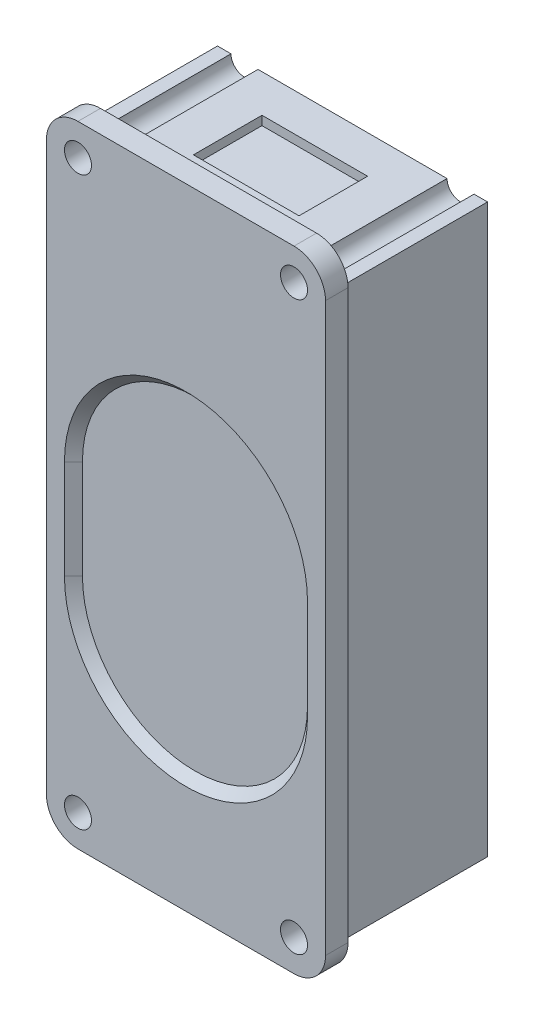
ISO-10303-21;
HEADER;
FILE_DESCRIPTION(('STEP AP214'),'2;1');
FILE_NAME('part.step','',(''),(''),'','','');
FILE_SCHEMA(('AUTOMOTIVE_DESIGN { 1 0 10303 214 1 1 1 1 }'));
ENDSEC;
DATA;
#1=APPLICATION_CONTEXT('core data for automotive mechanical design processes');
#2=APPLICATION_PROTOCOL_DEFINITION('international standard','automotive_design',2000,#1);
#3=PRODUCT_CONTEXT('',#1,'mechanical');
#4=PRODUCT('Part','Part','',(#3));
#5=PRODUCT_RELATED_PRODUCT_CATEGORY('part','',(#4));
#6=PRODUCT_DEFINITION_FORMATION('','',#4);
#7=PRODUCT_DEFINITION_CONTEXT('part definition',#1,'design');
#8=PRODUCT_DEFINITION('design','',#6,#7);
#9=PRODUCT_DEFINITION_SHAPE('','',#8);
#10=(LENGTH_UNIT() NAMED_UNIT(*) SI_UNIT(.MILLI.,.METRE.));
#11=(NAMED_UNIT(*) PLANE_ANGLE_UNIT() SI_UNIT($,.RADIAN.));
#12=(NAMED_UNIT(*) SI_UNIT($,.STERADIAN.) SOLID_ANGLE_UNIT());
#13=UNCERTAINTY_MEASURE_WITH_UNIT(LENGTH_MEASURE(1.E-05),#10,'distance_accuracy_value','');
#14=(GEOMETRIC_REPRESENTATION_CONTEXT(3) GLOBAL_UNCERTAINTY_ASSIGNED_CONTEXT((#13)) GLOBAL_UNIT_ASSIGNED_CONTEXT((#10,
#11,#12)) REPRESENTATION_CONTEXT('',''));
#15=CARTESIAN_POINT('',(0.,0.,0.));
#16=DIRECTION('',(0.,0.,1.));
#17=DIRECTION('',(1.,0.,0.));
#18=AXIS2_PLACEMENT_3D('',#15,#16,#17);
#19=CARTESIAN_POINT('',(15.,31.5,0.));
#20=DIRECTION('',(0.,-1.,0.));
#21=DIRECTION('',(0.,0.,-1.));
#22=AXIS2_PLACEMENT_3D('',#19,#20,#21);
#23=PLANE('',#22);
#24=DIRECTION('',(-1.,0.,0.));
#25=VECTOR('',#24,1.);
#26=CARTESIAN_POINT('',(-5.86625350488021,31.5,-11.8080308784381));
#27=LINE('',#26,#25);
#28=CARTESIAN_POINT('',(5.86625350488021,31.5,-11.8080308784381));
#29=VERTEX_POINT('',#28);
#30=CARTESIAN_POINT('',(-5.86625350488021,31.5,-11.8080308784381));
#31=VERTEX_POINT('',#30);
#32=EDGE_CURVE('E264',#29,#31,#27,.T.);
#33=ORIENTED_EDGE('',*,*,#32,.F.);
#34=DIRECTION('',(0.,0.,-1.));
#35=VECTOR('',#34,1.);
#36=CARTESIAN_POINT('',(5.86625350488021,31.5,-11.8080308784381));
#37=LINE('',#36,#35);
#38=CARTESIAN_POINT('',(5.86625350488021,31.5,-4.1919691215619));
#39=VERTEX_POINT('',#38);
#40=EDGE_CURVE('E58',#39,#29,#37,.T.);
#41=ORIENTED_EDGE('',*,*,#40,.F.);
#42=DIRECTION('',(1.,0.,0.));
#43=VECTOR('',#42,1.);
#44=CARTESIAN_POINT('',(-5.86625350488021,31.5,-4.1919691215619));
#45=LINE('',#44,#43);
#46=CARTESIAN_POINT('',(-5.86625350488021,31.5,-4.1919691215619));
#47=VERTEX_POINT('',#46);
#48=EDGE_CURVE('E251',#47,#39,#45,.T.);
#49=ORIENTED_EDGE('',*,*,#48,.F.);
#50=DIRECTION('',(0.,0.,1.));
#51=VECTOR('',#50,1.);
#52=CARTESIAN_POINT('',(-5.86625350488021,31.5,-11.8080308784381));
#53=LINE('',#52,#51);
#54=EDGE_CURVE('E255',#31,#47,#53,.T.);
#55=ORIENTED_EDGE('',*,*,#54,.F.);
#56=EDGE_LOOP('',(#33,#41,#49,#55));
#57=FACE_BOUND('',#56,.T.);
#58=DIRECTION('',(-1.,0.,0.));
#59=VECTOR('',#58,1.);
#60=CARTESIAN_POINT('',(15.,31.5,-16.));
#61=LINE('',#60,#59);
#62=CARTESIAN_POINT('',(10.5,31.5,-16.));
#63=VERTEX_POINT('',#62);
#64=CARTESIAN_POINT('',(-10.5,31.5,-16.));
#65=VERTEX_POINT('',#64);
#66=EDGE_CURVE('E421',#63,#65,#61,.T.);
#67=ORIENTED_EDGE('',*,*,#66,.T.);
#68=DIRECTION('',(0.,0.,1.));
#69=VECTOR('',#68,1.);
#70=CARTESIAN_POINT('',(-10.5,31.5,-16.));
#71=LINE('',#70,#69);
#72=CARTESIAN_POINT('',(-10.5,31.5,0.));
#73=VERTEX_POINT('',#72);
#74=EDGE_CURVE('E11',#65,#73,#71,.T.);
#75=ORIENTED_EDGE('',*,*,#74,.T.);
#76=DIRECTION('',(-1.,0.,0.));
#77=VECTOR('',#76,1.);
#78=CARTESIAN_POINT('',(15.,31.5,0.));
#79=LINE('',#78,#77);
#80=CARTESIAN_POINT('',(10.5,31.5,0.));
#81=VERTEX_POINT('',#80);
#82=EDGE_CURVE('E415',#81,#73,#79,.T.);
#83=ORIENTED_EDGE('',*,*,#82,.F.);
#84=DIRECTION('',(0.,0.,1.));
#85=VECTOR('',#84,1.);
#86=CARTESIAN_POINT('',(10.5,31.5,-16.));
#87=LINE('',#86,#85);
#88=EDGE_CURVE('E519',#81,#63,#87,.F.);
#89=ORIENTED_EDGE('',*,*,#88,.T.);
#90=EDGE_LOOP('',(#67,#75,#83,#89));
#91=FACE_BOUND('',#90,.T.);
#92=ADVANCED_FACE('F42',(#57,#91),#23,.F.);
#93=CARTESIAN_POINT('',(15.,31.5,-16.));
#94=VERTEX_POINT('',#93);
#95=CARTESIAN_POINT('',(13.5,31.5,-16.));
#96=VERTEX_POINT('',#95);
#97=EDGE_CURVE('E416',#94,#96,#61,.T.);
#98=ORIENTED_EDGE('',*,*,#97,.T.);
#99=DIRECTION('',(0.,0.,1.));
#100=VECTOR('',#99,1.);
#101=CARTESIAN_POINT('',(13.5,31.5,-16.));
#102=LINE('',#101,#100);
#103=CARTESIAN_POINT('',(13.5,31.5,0.));
#104=VERTEX_POINT('',#103);
#105=EDGE_CURVE('E523',#96,#104,#102,.T.);
#106=ORIENTED_EDGE('',*,*,#105,.T.);
#107=CARTESIAN_POINT('',(15.,31.5,0.));
#108=VERTEX_POINT('',#107);
#109=EDGE_CURVE('E410',#108,#104,#79,.T.);
#110=ORIENTED_EDGE('',*,*,#109,.F.);
#111=DIRECTION('',(0.,0.,1.));
#112=VECTOR('',#111,1.);
#113=CARTESIAN_POINT('',(15.,31.5,0.));
#114=LINE('',#113,#112);
#115=EDGE_CURVE('E373',#94,#108,#114,.T.);
#116=ORIENTED_EDGE('',*,*,#115,.F.);
#117=EDGE_LOOP('',(#98,#106,#110,#116));
#118=FACE_BOUND('',#117,.T.);
#119=ADVANCED_FACE('F548',(#118),#23,.F.);
#120=CARTESIAN_POINT('',(15.,-31.5,0.));
#121=DIRECTION('',(0.,1.,0.));
#122=DIRECTION('',(0.,0.,1.));
#123=AXIS2_PLACEMENT_3D('',#120,#121,#122);
#124=PLANE('',#123);
#125=DIRECTION('',(-1.,0.,0.));
#126=VECTOR('',#125,1.);
#127=CARTESIAN_POINT('',(15.,-31.5,-16.));
#128=LINE('',#127,#126);
#129=CARTESIAN_POINT('',(10.5,-31.5,-16.));
#130=VERTEX_POINT('',#129);
#131=CARTESIAN_POINT('',(-10.5,-31.5,-16.));
#132=VERTEX_POINT('',#131);
#133=EDGE_CURVE('E403',#130,#132,#128,.T.);
#134=ORIENTED_EDGE('',*,*,#133,.F.);
#135=DIRECTION('',(0.,0.,1.));
#136=VECTOR('',#135,1.);
#137=CARTESIAN_POINT('',(10.5,-31.5,-16.));
#138=LINE('',#137,#136);
#139=CARTESIAN_POINT('',(10.5,-31.5,0.));
#140=VERTEX_POINT('',#139);
#141=EDGE_CURVE('E515',#130,#140,#138,.T.);
#142=ORIENTED_EDGE('',*,*,#141,.T.);
#143=DIRECTION('',(-1.,0.,0.));
#144=VECTOR('',#143,1.);
#145=CARTESIAN_POINT('',(15.,-31.5,0.));
#146=LINE('',#145,#144);
#147=CARTESIAN_POINT('',(-10.5,-31.5,0.));
#148=VERTEX_POINT('',#147);
#149=EDGE_CURVE('E409',#140,#148,#146,.T.);
#150=ORIENTED_EDGE('',*,*,#149,.T.);
#151=DIRECTION('',(0.,0.,1.));
#152=VECTOR('',#151,1.);
#153=CARTESIAN_POINT('',(-10.5,-31.5,-16.));
#154=LINE('',#153,#152);
#155=EDGE_CURVE('E503',#148,#132,#154,.F.);
#156=ORIENTED_EDGE('',*,*,#155,.T.);
#157=EDGE_LOOP('',(#134,#142,#150,#156));
#158=FACE_BOUND('',#157,.T.);
#159=ADVANCED_FACE('F601',(#158),#124,.F.);
#160=CARTESIAN_POINT('',(-13.5,-31.5,-16.));
#161=VERTEX_POINT('',#160);
#162=CARTESIAN_POINT('',(-15.,-31.5,-16.));
#163=VERTEX_POINT('',#162);
#164=EDGE_CURVE('E383',#161,#163,#128,.T.);
#165=ORIENTED_EDGE('',*,*,#164,.F.);
#166=DIRECTION('',(0.,0.,1.));
#167=VECTOR('',#166,1.);
#168=CARTESIAN_POINT('',(-13.5,-31.5,-16.));
#169=LINE('',#168,#167);
#170=CARTESIAN_POINT('',(-13.5,-31.5,0.));
#171=VERTEX_POINT('',#170);
#172=EDGE_CURVE('E507',#161,#171,#169,.T.);
#173=ORIENTED_EDGE('',*,*,#172,.T.);
#174=CARTESIAN_POINT('',(-15.,-31.5,0.));
#175=VERTEX_POINT('',#174);
#176=EDGE_CURVE('E402',#171,#175,#146,.T.);
#177=ORIENTED_EDGE('',*,*,#176,.T.);
#178=DIRECTION('',(0.,0.,-1.));
#179=VECTOR('',#178,1.);
#180=CARTESIAN_POINT('',(-15.,-31.5,0.));
#181=LINE('',#180,#179);
#182=EDGE_CURVE('E374',#175,#163,#181,.T.);
#183=ORIENTED_EDGE('',*,*,#182,.T.);
#184=EDGE_LOOP('',(#165,#173,#177,#183));
#185=FACE_BOUND('',#184,.T.);
#186=ADVANCED_FACE('F574',(#185),#124,.F.);
#187=CARTESIAN_POINT('',(12.,-31.5,2.5));
#188=DIRECTION('',(0.,0.,-1.));
#189=DIRECTION('',(-1.,0.,0.));
#190=AXIS2_PLACEMENT_3D('',#187,#188,#189);
#191=CYLINDRICAL_SURFACE('',#190,3.5);
#192=CARTESIAN_POINT('',(12.,-31.5,0.));
#193=DIRECTION('',(0.,0.,1.));
#194=DIRECTION('',(1.,0.,0.));
#195=AXIS2_PLACEMENT_3D('',#192,#193,#194);
#196=CIRCLE('',#195,3.5);
#197=CARTESIAN_POINT('',(12.,-35.,0.));
#198=VERTEX_POINT('',#197);
#199=CARTESIAN_POINT('',(15.5,-31.5,0.));
#200=VERTEX_POINT('',#199);
#201=EDGE_CURVE('E420',#198,#200,#196,.T.);
#202=ORIENTED_EDGE('',*,*,#201,.T.);
#203=DIRECTION('',(0.,0.,-1.));
#204=VECTOR('',#203,1.);
#205=CARTESIAN_POINT('',(15.5,-31.5,2.5));
#206=LINE('',#205,#204);
#207=CARTESIAN_POINT('',(15.5,-31.5,2.5));
#208=VERTEX_POINT('',#207);
#209=EDGE_CURVE('E499',#208,#200,#206,.T.);
#210=ORIENTED_EDGE('',*,*,#209,.F.);
#211=CARTESIAN_POINT('',(12.,-31.5,2.5));
#212=DIRECTION('',(0.,0.,1.));
#213=DIRECTION('',(1.,0.,0.));
#214=AXIS2_PLACEMENT_3D('',#211,#212,#213);
#215=CIRCLE('',#214,3.5);
#216=CARTESIAN_POINT('',(12.,-35.,2.5));
#217=VERTEX_POINT('',#216);
#218=EDGE_CURVE('E422',#217,#208,#215,.T.);
#219=ORIENTED_EDGE('',*,*,#218,.F.);
#220=DIRECTION('',(0.,0.,-1.));
#221=VECTOR('',#220,1.);
#222=CARTESIAN_POINT('',(12.,-35.,2.5));
#223=LINE('',#222,#221);
#224=EDGE_CURVE('E448',#217,#198,#223,.T.);
#225=ORIENTED_EDGE('',*,*,#224,.T.);
#226=EDGE_LOOP('',(#202,#210,#219,#225));
#227=FACE_BOUND('',#226,.T.);
#228=ADVANCED_FACE('F44',(#227),#191,.T.);
#229=CARTESIAN_POINT('',(15.5,31.5,2.5));
#230=DIRECTION('',(-1.,0.,0.));
#231=DIRECTION('',(0.,-1.,0.));
#232=AXIS2_PLACEMENT_3D('',#229,#230,#231);
#233=PLANE('',#232);
#234=DIRECTION('',(0.,1.,0.));
#235=VECTOR('',#234,1.);
#236=CARTESIAN_POINT('',(15.5,31.5,0.));
#237=LINE('',#236,#235);
#238=CARTESIAN_POINT('',(15.5,31.5,0.));
#239=VERTEX_POINT('',#238);
#240=EDGE_CURVE('E452',#200,#239,#237,.T.);
#241=ORIENTED_EDGE('',*,*,#240,.T.);
#242=DIRECTION('',(0.,0.,-1.));
#243=VECTOR('',#242,1.);
#244=CARTESIAN_POINT('',(15.5,31.5,2.5));
#245=LINE('',#244,#243);
#246=CARTESIAN_POINT('',(15.5,31.5,2.5));
#247=VERTEX_POINT('',#246);
#248=EDGE_CURVE('E495',#247,#239,#245,.T.);
#249=ORIENTED_EDGE('',*,*,#248,.F.);
#250=DIRECTION('',(0.,1.,0.));
#251=VECTOR('',#250,1.);
#252=CARTESIAN_POINT('',(15.5,31.5,2.5));
#253=LINE('',#252,#251);
#254=EDGE_CURVE('E426',#208,#247,#253,.T.);
#255=ORIENTED_EDGE('',*,*,#254,.F.);
#256=ORIENTED_EDGE('',*,*,#209,.T.);
#257=EDGE_LOOP('',(#241,#249,#255,#256));
#258=FACE_BOUND('',#257,.T.);
#259=ADVANCED_FACE('F640',(#258),#233,.F.);
#260=CARTESIAN_POINT('',(12.,31.5,2.5));
#261=DIRECTION('',(0.,0.,-1.));
#262=DIRECTION('',(-1.,0.,0.));
#263=AXIS2_PLACEMENT_3D('',#260,#261,#262);
#264=CYLINDRICAL_SURFACE('',#263,3.5);
#265=CARTESIAN_POINT('',(12.,31.5,0.));
#266=DIRECTION('',(0.,0.,1.));
#267=DIRECTION('',(-1.,0.,0.));
#268=AXIS2_PLACEMENT_3D('',#265,#266,#267);
#269=CIRCLE('',#268,3.5);
#270=CARTESIAN_POINT('',(12.,35.,0.));
#271=VERTEX_POINT('',#270);
#272=EDGE_CURVE('E455',#239,#271,#269,.T.);
#273=ORIENTED_EDGE('',*,*,#272,.T.);
#274=DIRECTION('',(0.,0.,-1.));
#275=VECTOR('',#274,1.);
#276=CARTESIAN_POINT('',(12.,35.,2.5));
#277=LINE('',#276,#275);
#278=CARTESIAN_POINT('',(12.,35.,2.5));
#279=VERTEX_POINT('',#278);
#280=EDGE_CURVE('E491',#279,#271,#277,.T.);
#281=ORIENTED_EDGE('',*,*,#280,.F.);
#282=CARTESIAN_POINT('',(12.,31.5,2.5));
#283=DIRECTION('',(0.,0.,1.));
#284=DIRECTION('',(-1.,0.,0.));
#285=AXIS2_PLACEMENT_3D('',#282,#283,#284);
#286=CIRCLE('',#285,3.5);
#287=EDGE_CURVE('E430',#247,#279,#286,.T.);
#288=ORIENTED_EDGE('',*,*,#287,.F.);
#289=ORIENTED_EDGE('',*,*,#248,.T.);
#290=EDGE_LOOP('',(#273,#281,#288,#289));
#291=FACE_BOUND('',#290,.T.);
#292=ADVANCED_FACE('F637',(#291),#264,.T.);
#293=CARTESIAN_POINT('',(-12.,35.,2.5));
#294=DIRECTION('',(0.,-1.,0.));
#295=DIRECTION('',(0.,0.,-1.));
#296=AXIS2_PLACEMENT_3D('',#293,#294,#295);
#297=PLANE('',#296);
#298=DIRECTION('',(-1.,0.,0.));
#299=VECTOR('',#298,1.);
#300=CARTESIAN_POINT('',(-12.,35.,0.));
#301=LINE('',#300,#299);
#302=CARTESIAN_POINT('',(-12.,35.,0.));
#303=VERTEX_POINT('',#302);
#304=EDGE_CURVE('E458',#271,#303,#301,.T.);
#305=ORIENTED_EDGE('',*,*,#304,.T.);
#306=DIRECTION('',(0.,0.,-1.));
#307=VECTOR('',#306,1.);
#308=CARTESIAN_POINT('',(-12.,35.,2.5));
#309=LINE('',#308,#307);
#310=CARTESIAN_POINT('',(-12.,35.,2.5));
#311=VERTEX_POINT('',#310);
#312=EDGE_CURVE('E487',#311,#303,#309,.T.);
#313=ORIENTED_EDGE('',*,*,#312,.F.);
#314=DIRECTION('',(-1.,0.,0.));
#315=VECTOR('',#314,1.);
#316=CARTESIAN_POINT('',(-12.,35.,2.5));
#317=LINE('',#316,#315);
#318=EDGE_CURVE('E433',#279,#311,#317,.T.);
#319=ORIENTED_EDGE('',*,*,#318,.F.);
#320=ORIENTED_EDGE('',*,*,#280,.T.);
#321=EDGE_LOOP('',(#305,#313,#319,#320));
#322=FACE_BOUND('',#321,.T.);
#323=ADVANCED_FACE('F633',(#322),#297,.F.);
#324=CARTESIAN_POINT('',(-12.,31.5,2.5));
#325=DIRECTION('',(0.,0.,-1.));
#326=DIRECTION('',(-1.,0.,0.));
#327=AXIS2_PLACEMENT_3D('',#324,#325,#326);
#328=CYLINDRICAL_SURFACE('',#327,3.5);
#329=CARTESIAN_POINT('',(-12.,31.5,0.));
#330=DIRECTION('',(0.,0.,1.));
#331=DIRECTION('',(1.,0.,0.));
#332=AXIS2_PLACEMENT_3D('',#329,#330,#331);
#333=CIRCLE('',#332,3.5);
#334=CARTESIAN_POINT('',(-15.5,31.5,0.));
#335=VERTEX_POINT('',#334);
#336=EDGE_CURVE('E461',#303,#335,#333,.T.);
#337=ORIENTED_EDGE('',*,*,#336,.T.);
#338=DIRECTION('',(0.,0.,-1.));
#339=VECTOR('',#338,1.);
#340=CARTESIAN_POINT('',(-15.5,31.5,2.5));
#341=LINE('',#340,#339);
#342=CARTESIAN_POINT('',(-15.5,31.5,2.5));
#343=VERTEX_POINT('',#342);
#344=EDGE_CURVE('E483',#343,#335,#341,.T.);
#345=ORIENTED_EDGE('',*,*,#344,.F.);
#346=CARTESIAN_POINT('',(-12.,31.5,2.5));
#347=DIRECTION('',(0.,0.,1.));
#348=DIRECTION('',(1.,0.,0.));
#349=AXIS2_PLACEMENT_3D('',#346,#347,#348);
#350=CIRCLE('',#349,3.5);
#351=EDGE_CURVE('E436',#311,#343,#350,.T.);
#352=ORIENTED_EDGE('',*,*,#351,.F.);
#353=ORIENTED_EDGE('',*,*,#312,.T.);
#354=EDGE_LOOP('',(#337,#345,#352,#353));
#355=FACE_BOUND('',#354,.T.);
#356=ADVANCED_FACE('F629',(#355),#328,.T.);
#357=CARTESIAN_POINT('',(-15.5,31.5,2.5));
#358=DIRECTION('',(1.,0.,0.));
#359=DIRECTION('',(0.,1.,0.));
#360=AXIS2_PLACEMENT_3D('',#357,#358,#359);
#361=PLANE('',#360);
#362=DIRECTION('',(0.,-1.,0.));
#363=VECTOR('',#362,1.);
#364=CARTESIAN_POINT('',(-15.5,31.5,0.));
#365=LINE('',#364,#363);
#366=CARTESIAN_POINT('',(-15.5,-31.5,0.));
#367=VERTEX_POINT('',#366);
#368=EDGE_CURVE('E464',#335,#367,#365,.T.);
#369=ORIENTED_EDGE('',*,*,#368,.T.);
#370=DIRECTION('',(0.,0.,-1.));
#371=VECTOR('',#370,1.);
#372=CARTESIAN_POINT('',(-15.5,-31.5,2.5));
#373=LINE('',#372,#371);
#374=CARTESIAN_POINT('',(-15.5,-31.5,2.5));
#375=VERTEX_POINT('',#374);
#376=EDGE_CURVE('E479',#375,#367,#373,.T.);
#377=ORIENTED_EDGE('',*,*,#376,.F.);
#378=DIRECTION('',(0.,-1.,0.));
#379=VECTOR('',#378,1.);
#380=CARTESIAN_POINT('',(-15.5,31.5,2.5));
#381=LINE('',#380,#379);
#382=EDGE_CURVE('E439',#343,#375,#381,.T.);
#383=ORIENTED_EDGE('',*,*,#382,.F.);
#384=ORIENTED_EDGE('',*,*,#344,.T.);
#385=EDGE_LOOP('',(#369,#377,#383,#384));
#386=FACE_BOUND('',#385,.T.);
#387=ADVANCED_FACE('F625',(#386),#361,.F.);
#388=CARTESIAN_POINT('',(-12.,-31.5,2.5));
#389=DIRECTION('',(0.,0.,-1.));
#390=DIRECTION('',(-1.,0.,0.));
#391=AXIS2_PLACEMENT_3D('',#388,#389,#390);
#392=CYLINDRICAL_SURFACE('',#391,3.5);
#393=CARTESIAN_POINT('',(-12.,-31.5,0.));
#394=DIRECTION('',(0.,0.,1.));
#395=DIRECTION('',(1.,0.,0.));
#396=AXIS2_PLACEMENT_3D('',#393,#394,#395);
#397=CIRCLE('',#396,3.5);
#398=CARTESIAN_POINT('',(-12.,-35.,0.));
#399=VERTEX_POINT('',#398);
#400=EDGE_CURVE('E467',#367,#399,#397,.T.);
#401=ORIENTED_EDGE('',*,*,#400,.T.);
#402=DIRECTION('',(0.,0.,-1.));
#403=VECTOR('',#402,1.);
#404=CARTESIAN_POINT('',(-12.,-35.,2.5));
#405=LINE('',#404,#403);
#406=CARTESIAN_POINT('',(-12.,-35.,2.5));
#407=VERTEX_POINT('',#406);
#408=EDGE_CURVE('E475',#407,#399,#405,.T.);
#409=ORIENTED_EDGE('',*,*,#408,.F.);
#410=CARTESIAN_POINT('',(-12.,-31.5,2.5));
#411=DIRECTION('',(0.,0.,1.));
#412=DIRECTION('',(1.,0.,0.));
#413=AXIS2_PLACEMENT_3D('',#410,#411,#412);
#414=CIRCLE('',#413,3.5);
#415=EDGE_CURVE('E442',#375,#407,#414,.T.);
#416=ORIENTED_EDGE('',*,*,#415,.F.);
#417=ORIENTED_EDGE('',*,*,#376,.T.);
#418=EDGE_LOOP('',(#401,#409,#416,#417));
#419=FACE_BOUND('',#418,.T.);
#420=ADVANCED_FACE('F621',(#419),#392,.T.);
#421=CARTESIAN_POINT('',(-12.,-35.,2.5));
#422=DIRECTION('',(0.,1.,0.));
#423=DIRECTION('',(0.,0.,1.));
#424=AXIS2_PLACEMENT_3D('',#421,#422,#423);
#425=PLANE('',#424);
#426=DIRECTION('',(1.,0.,0.));
#427=VECTOR('',#426,1.);
#428=CARTESIAN_POINT('',(-12.,-35.,0.));
#429=LINE('',#428,#427);
#430=EDGE_CURVE('E427',#399,#198,#429,.T.);
#431=ORIENTED_EDGE('',*,*,#430,.T.);
#432=ORIENTED_EDGE('',*,*,#224,.F.);
#433=DIRECTION('',(1.,0.,0.));
#434=VECTOR('',#433,1.);
#435=CARTESIAN_POINT('',(-12.,-35.,2.5));
#436=LINE('',#435,#434);
#437=EDGE_CURVE('E445',#407,#217,#436,.T.);
#438=ORIENTED_EDGE('',*,*,#437,.F.);
#439=ORIENTED_EDGE('',*,*,#408,.T.);
#440=EDGE_LOOP('',(#431,#432,#438,#439));
#441=FACE_BOUND('',#440,.T.);
#442=ADVANCED_FACE('F616',(#441),#425,.F.);
#443=CARTESIAN_POINT('',(12.,-31.5,2.5));
#444=DIRECTION('',(0.,0.,1.));
#445=DIRECTION('',(1.,0.,0.));
#446=AXIS2_PLACEMENT_3D('',#443,#444,#445);
#447=PLANE('',#446);
#448=CARTESIAN_POINT('',(0.,1.5,2.5));
#449=DIRECTION('',(0.,0.,1.));
#450=DIRECTION('',(1.,0.,0.));
#451=AXIS2_PLACEMENT_3D('',#448,#449,#450);
#452=CIRCLE('',#451,13.5);
#453=CARTESIAN_POINT('',(13.5,1.5,2.5));
#454=VERTEX_POINT('',#453);
#455=CARTESIAN_POINT('',(-13.5,1.50000000000003,2.5));
#456=VERTEX_POINT('',#455);
#457=EDGE_CURVE('E66',#454,#456,#452,.T.);
#458=ORIENTED_EDGE('',*,*,#457,.F.);
#459=DIRECTION('',(0.,1.,0.));
#460=VECTOR('',#459,1.);
#461=CARTESIAN_POINT('',(13.5,1.5,2.5));
#462=LINE('',#461,#460);
#463=CARTESIAN_POINT('',(13.5,-9.5,2.5));
#464=VERTEX_POINT('',#463);
#465=EDGE_CURVE('E288',#464,#454,#462,.T.);
#466=ORIENTED_EDGE('',*,*,#465,.F.);
#467=CARTESIAN_POINT('',(0.,-9.50000000000001,2.5));
#468=DIRECTION('',(0.,0.,1.));
#469=DIRECTION('',(1.,0.,0.));
#470=AXIS2_PLACEMENT_3D('',#467,#468,#469);
#471=CIRCLE('',#470,13.5);
#472=CARTESIAN_POINT('',(-13.5,-9.50000000000001,2.5));
#473=VERTEX_POINT('',#472);
#474=EDGE_CURVE('E284',#473,#464,#471,.T.);
#475=ORIENTED_EDGE('',*,*,#474,.F.);
#476=DIRECTION('',(0.,-1.,0.));
#477=VECTOR('',#476,1.);
#478=CARTESIAN_POINT('',(-13.5,1.50000000000003,2.5));
#479=LINE('',#478,#477);
#480=EDGE_CURVE('E280',#456,#473,#479,.T.);
#481=ORIENTED_EDGE('',*,*,#480,.F.);
#482=EDGE_LOOP('',(#458,#466,#475,#481));
#483=FACE_BOUND('',#482,.T.);
#484=CARTESIAN_POINT('',(-12.,31.5,2.5));
#485=DIRECTION('',(0.,0.,1.));
#486=DIRECTION('',(-1.,0.,0.));
#487=AXIS2_PLACEMENT_3D('',#484,#485,#486);
#488=CIRCLE('',#487,1.5);
#489=CARTESIAN_POINT('',(-13.5,31.5,2.5));
#490=VERTEX_POINT('',#489);
#491=EDGE_CURVE('E335',#490,#490,#488,.T.);
#492=ORIENTED_EDGE('',*,*,#491,.F.);
#493=EDGE_LOOP('',(#492));
#494=FACE_BOUND('',#493,.T.);
#495=CARTESIAN_POINT('',(12.,31.5,2.5));
#496=DIRECTION('',(0.,0.,1.));
#497=DIRECTION('',(-1.,0.,0.));
#498=AXIS2_PLACEMENT_3D('',#495,#496,#497);
#499=CIRCLE('',#498,1.5);
#500=CARTESIAN_POINT('',(10.5,31.5,2.5));
#501=VERTEX_POINT('',#500);
#502=EDGE_CURVE('E326',#501,#501,#499,.T.);
#503=ORIENTED_EDGE('',*,*,#502,.F.);
#504=EDGE_LOOP('',(#503));
#505=FACE_BOUND('',#504,.T.);
#506=CARTESIAN_POINT('',(12.,-31.5,2.5));
#507=DIRECTION('',(0.,0.,1.));
#508=DIRECTION('',(1.,0.,0.));
#509=AXIS2_PLACEMENT_3D('',#506,#507,#508);
#510=CIRCLE('',#509,1.5);
#511=CARTESIAN_POINT('',(13.5,-31.5,2.5));
#512=VERTEX_POINT('',#511);
#513=EDGE_CURVE('E325',#512,#512,#510,.T.);
#514=ORIENTED_EDGE('',*,*,#513,.F.);
#515=EDGE_LOOP('',(#514));
#516=FACE_BOUND('',#515,.T.);
#517=CARTESIAN_POINT('',(-12.,-31.5,2.5));
#518=DIRECTION('',(0.,0.,1.));
#519=DIRECTION('',(1.,0.,0.));
#520=AXIS2_PLACEMENT_3D('',#517,#518,#519);
#521=CIRCLE('',#520,1.5);
#522=CARTESIAN_POINT('',(-10.5,-31.5,2.5));
#523=VERTEX_POINT('',#522);
#524=EDGE_CURVE('E330',#523,#523,#521,.T.);
#525=ORIENTED_EDGE('',*,*,#524,.F.);
#526=EDGE_LOOP('',(#525));
#527=FACE_BOUND('',#526,.T.);
#528=ORIENTED_EDGE('',*,*,#218,.T.);
#529=ORIENTED_EDGE('',*,*,#254,.T.);
#530=ORIENTED_EDGE('',*,*,#287,.T.);
#531=ORIENTED_EDGE('',*,*,#318,.T.);
#532=ORIENTED_EDGE('',*,*,#351,.T.);
#533=ORIENTED_EDGE('',*,*,#382,.T.);
#534=ORIENTED_EDGE('',*,*,#415,.T.);
#535=ORIENTED_EDGE('',*,*,#437,.T.);
#536=EDGE_LOOP('',(#528,#529,#530,#531,#532,#533,#534,#535));
#537=FACE_BOUND('',#536,.T.);
#538=ADVANCED_FACE('F612',(#483,#494,#505,#516,#527,#537),#447,.T.);
#539=CARTESIAN_POINT('',(12.,-31.5,0.));
#540=DIRECTION('',(0.,0.,1.));
#541=DIRECTION('',(1.,0.,0.));
#542=AXIS2_PLACEMENT_3D('',#539,#540,#541);
#543=PLANE('',#542);
#544=ORIENTED_EDGE('',*,*,#82,.T.);
#545=CARTESIAN_POINT('',(-12.,31.5,0.));
#546=DIRECTION('',(0.,0.,1.));
#547=DIRECTION('',(1.,0.,0.));
#548=AXIS2_PLACEMENT_3D('',#545,#546,#547);
#549=CIRCLE('',#548,1.5);
#550=CARTESIAN_POINT('',(-13.5,31.5,0.));
#551=VERTEX_POINT('',#550);
#552=EDGE_CURVE('E364',#73,#551,#549,.T.);
#553=ORIENTED_EDGE('',*,*,#552,.T.);
#554=CARTESIAN_POINT('',(-15.,31.5,0.));
#555=VERTEX_POINT('',#554);
#556=EDGE_CURVE('E408',#551,#555,#79,.T.);
#557=ORIENTED_EDGE('',*,*,#556,.T.);
#558=DIRECTION('',(0.,-1.,0.));
#559=VECTOR('',#558,1.);
#560=CARTESIAN_POINT('',(-15.,-31.5,0.));
#561=LINE('',#560,#559);
#562=EDGE_CURVE('E391',#555,#175,#561,.T.);
#563=ORIENTED_EDGE('',*,*,#562,.T.);
#564=ORIENTED_EDGE('',*,*,#176,.F.);
#565=CARTESIAN_POINT('',(-12.,-31.5,0.));
#566=DIRECTION('',(0.,0.,1.));
#567=DIRECTION('',(1.,0.,0.));
#568=AXIS2_PLACEMENT_3D('',#565,#566,#567);
#569=CIRCLE('',#568,1.5);
#570=EDGE_CURVE('E352',#171,#148,#569,.T.);
#571=ORIENTED_EDGE('',*,*,#570,.T.);
#572=ORIENTED_EDGE('',*,*,#149,.F.);
#573=CARTESIAN_POINT('',(12.,-31.5,0.));
#574=DIRECTION('',(0.,0.,1.));
#575=DIRECTION('',(1.,0.,0.));
#576=AXIS2_PLACEMENT_3D('',#573,#574,#575);
#577=CIRCLE('',#576,1.5);
#578=CARTESIAN_POINT('',(13.5,-31.5,0.));
#579=VERTEX_POINT('',#578);
#580=EDGE_CURVE('E356',#140,#579,#577,.T.);
#581=ORIENTED_EDGE('',*,*,#580,.T.);
#582=CARTESIAN_POINT('',(15.,-31.5,0.));
#583=VERTEX_POINT('',#582);
#584=EDGE_CURVE('E404',#583,#579,#146,.T.);
#585=ORIENTED_EDGE('',*,*,#584,.F.);
#586=DIRECTION('',(0.,-1.,0.));
#587=VECTOR('',#586,1.);
#588=CARTESIAN_POINT('',(15.,-31.5,0.));
#589=LINE('',#588,#587);
#590=EDGE_CURVE('E377',#108,#583,#589,.T.);
#591=ORIENTED_EDGE('',*,*,#590,.F.);
#592=ORIENTED_EDGE('',*,*,#109,.T.);
#593=CARTESIAN_POINT('',(12.,31.5,0.));
#594=DIRECTION('',(0.,0.,1.));
#595=DIRECTION('',(1.,0.,0.));
#596=AXIS2_PLACEMENT_3D('',#593,#594,#595);
#597=CIRCLE('',#596,1.5);
#598=EDGE_CURVE('E360',#104,#81,#597,.T.);
#599=ORIENTED_EDGE('',*,*,#598,.T.);
#600=EDGE_LOOP('',(#544,#553,#557,#563,#564,#571,#572,#581,#585,#591,#592,#599));
#601=FACE_BOUND('',#600,.T.);
#602=ORIENTED_EDGE('',*,*,#201,.F.);
#603=ORIENTED_EDGE('',*,*,#430,.F.);
#604=ORIENTED_EDGE('',*,*,#400,.F.);
#605=ORIENTED_EDGE('',*,*,#368,.F.);
#606=ORIENTED_EDGE('',*,*,#336,.F.);
#607=ORIENTED_EDGE('',*,*,#304,.F.);
#608=ORIENTED_EDGE('',*,*,#272,.F.);
#609=ORIENTED_EDGE('',*,*,#240,.F.);
#610=EDGE_LOOP('',(#602,#603,#604,#605,#606,#607,#608,#609));
#611=FACE_BOUND('',#610,.T.);
#612=ADVANCED_FACE('F564',(#601,#611),#543,.F.);
#613=CARTESIAN_POINT('',(15.,-31.5,-16.));
#614=DIRECTION('',(0.,0.,1.));
#615=DIRECTION('',(0.,-1.,0.));
#616=AXIS2_PLACEMENT_3D('',#613,#614,#615);
#617=PLANE('',#616);
#618=CARTESIAN_POINT('',(-13.5,31.5,-16.));
#619=VERTEX_POINT('',#618);
#620=CARTESIAN_POINT('',(-15.,31.5,-16.));
#621=VERTEX_POINT('',#620);
#622=EDGE_CURVE('E414',#619,#621,#61,.T.);
#623=ORIENTED_EDGE('',*,*,#622,.F.);
#624=CARTESIAN_POINT('',(-12.,31.5,-16.));
#625=DIRECTION('',(0.,0.,1.));
#626=DIRECTION('',(-1.,0.,0.));
#627=AXIS2_PLACEMENT_3D('',#624,#625,#626);
#628=CIRCLE('',#627,1.5);
#629=EDGE_CURVE('E296',#619,#65,#628,.T.);
#630=ORIENTED_EDGE('',*,*,#629,.T.);
#631=ORIENTED_EDGE('',*,*,#66,.F.);
#632=CARTESIAN_POINT('',(12.,31.5,-16.));
#633=DIRECTION('',(0.,0.,1.));
#634=DIRECTION('',(-1.,0.,0.));
#635=AXIS2_PLACEMENT_3D('',#632,#633,#634);
#636=CIRCLE('',#635,1.5);
#637=EDGE_CURVE('E331',#63,#96,#636,.T.);
#638=ORIENTED_EDGE('',*,*,#637,.T.);
#639=ORIENTED_EDGE('',*,*,#97,.F.);
#640=DIRECTION('',(0.,1.,0.));
#641=VECTOR('',#640,1.);
#642=CARTESIAN_POINT('',(15.,-31.5,-16.));
#643=LINE('',#642,#641);
#644=CARTESIAN_POINT('',(15.,-31.5,-16.));
#645=VERTEX_POINT('',#644);
#646=EDGE_CURVE('E369',#645,#94,#643,.T.);
#647=ORIENTED_EDGE('',*,*,#646,.F.);
#648=CARTESIAN_POINT('',(13.5,-31.5,-16.));
#649=VERTEX_POINT('',#648);
#650=EDGE_CURVE('E398',#645,#649,#128,.T.);
#651=ORIENTED_EDGE('',*,*,#650,.T.);
#652=CARTESIAN_POINT('',(12.,-31.5,-16.));
#653=DIRECTION('',(0.,0.,1.));
#654=DIRECTION('',(1.,0.,0.));
#655=AXIS2_PLACEMENT_3D('',#652,#653,#654);
#656=CIRCLE('',#655,1.5);
#657=EDGE_CURVE('E321',#649,#130,#656,.T.);
#658=ORIENTED_EDGE('',*,*,#657,.T.);
#659=ORIENTED_EDGE('',*,*,#133,.T.);
#660=CARTESIAN_POINT('',(-12.,-31.5,-16.));
#661=DIRECTION('',(0.,0.,1.));
#662=DIRECTION('',(1.,0.,0.));
#663=AXIS2_PLACEMENT_3D('',#660,#661,#662);
#664=CIRCLE('',#663,1.5);
#665=EDGE_CURVE('E348',#132,#161,#664,.T.);
#666=ORIENTED_EDGE('',*,*,#665,.T.);
#667=ORIENTED_EDGE('',*,*,#164,.T.);
#668=DIRECTION('',(0.,1.,0.));
#669=VECTOR('',#668,1.);
#670=CARTESIAN_POINT('',(-15.,-31.5,-16.));
#671=LINE('',#670,#669);
#672=EDGE_CURVE('E368',#163,#621,#671,.T.);
#673=ORIENTED_EDGE('',*,*,#672,.T.);
#674=EDGE_LOOP('',(#623,#630,#631,#638,#639,#647,#651,#658,#659,#666,#667,#673));
#675=FACE_BOUND('',#674,.T.);
#676=ADVANCED_FACE('F535',(#675),#617,.F.);
#677=ORIENTED_EDGE('',*,*,#556,.F.);
#678=DIRECTION('',(0.,0.,1.));
#679=VECTOR('',#678,1.);
#680=CARTESIAN_POINT('',(-13.5,31.5,-16.));
#681=LINE('',#680,#679);
#682=EDGE_CURVE('E51',#551,#619,#681,.F.);
#683=ORIENTED_EDGE('',*,*,#682,.T.);
#684=ORIENTED_EDGE('',*,*,#622,.T.);
#685=DIRECTION('',(0.,0.,1.));
#686=VECTOR('',#685,1.);
#687=CARTESIAN_POINT('',(-15.,31.5,0.));
#688=LINE('',#687,#686);
#689=EDGE_CURVE('E387',#621,#555,#688,.T.);
#690=ORIENTED_EDGE('',*,*,#689,.T.);
#691=EDGE_LOOP('',(#677,#683,#684,#690));
#692=FACE_BOUND('',#691,.T.);
#693=ADVANCED_FACE('F531',(#692),#23,.F.);
#694=ORIENTED_EDGE('',*,*,#584,.T.);
#695=DIRECTION('',(0.,0.,1.));
#696=VECTOR('',#695,1.);
#697=CARTESIAN_POINT('',(13.5,-31.5,-16.));
#698=LINE('',#697,#696);
#699=EDGE_CURVE('E511',#579,#649,#698,.F.);
#700=ORIENTED_EDGE('',*,*,#699,.T.);
#701=ORIENTED_EDGE('',*,*,#650,.F.);
#702=DIRECTION('',(0.,0.,-1.));
#703=VECTOR('',#702,1.);
#704=CARTESIAN_POINT('',(15.,-31.5,0.));
#705=LINE('',#704,#703);
#706=EDGE_CURVE('E380',#583,#645,#705,.T.);
#707=ORIENTED_EDGE('',*,*,#706,.F.);
#708=EDGE_LOOP('',(#694,#700,#701,#707));
#709=FACE_BOUND('',#708,.T.);
#710=ADVANCED_FACE('F558',(#709),#124,.F.);
#711=CARTESIAN_POINT('',(15.,0.,0.));
#712=DIRECTION('',(-1.,0.,0.));
#713=DIRECTION('',(0.,0.,1.));
#714=AXIS2_PLACEMENT_3D('',#711,#712,#713);
#715=PLANE('',#714);
#716=ORIENTED_EDGE('',*,*,#646,.T.);
#717=ORIENTED_EDGE('',*,*,#115,.T.);
#718=ORIENTED_EDGE('',*,*,#590,.T.);
#719=ORIENTED_EDGE('',*,*,#706,.T.);
#720=EDGE_LOOP('',(#716,#717,#718,#719));
#721=FACE_BOUND('',#720,.T.);
#722=ADVANCED_FACE('F552',(#721),#715,.F.);
#723=CARTESIAN_POINT('',(-15.,0.,0.));
#724=DIRECTION('',(-1.,0.,0.));
#725=DIRECTION('',(0.,0.,1.));
#726=AXIS2_PLACEMENT_3D('',#723,#724,#725);
#727=PLANE('',#726);
#728=ORIENTED_EDGE('',*,*,#672,.F.);
#729=ORIENTED_EDGE('',*,*,#182,.F.);
#730=ORIENTED_EDGE('',*,*,#562,.F.);
#731=ORIENTED_EDGE('',*,*,#689,.F.);
#732=EDGE_LOOP('',(#728,#729,#730,#731));
#733=FACE_BOUND('',#732,.T.);
#734=ADVANCED_FACE('F577',(#733),#727,.T.);
#735=CARTESIAN_POINT('',(-12.,-31.5,-16.));
#736=DIRECTION('',(0.,0.,1.));
#737=DIRECTION('',(1.,0.,0.));
#738=AXIS2_PLACEMENT_3D('',#735,#736,#737);
#739=CYLINDRICAL_SURFACE('',#738,1.5);
#740=ORIENTED_EDGE('',*,*,#524,.T.);
#741=EDGE_LOOP('',(#740));
#742=FACE_BOUND('',#741,.T.);
#743=ORIENTED_EDGE('',*,*,#665,.F.);
#744=ORIENTED_EDGE('',*,*,#155,.F.);
#745=ORIENTED_EDGE('',*,*,#570,.F.);
#746=ORIENTED_EDGE('',*,*,#172,.F.);
#747=EDGE_LOOP('',(#743,#744,#745,#746));
#748=FACE_BOUND('',#747,.T.);
#749=ADVANCED_FACE('F592',(#742,#748),#739,.F.);
#750=CARTESIAN_POINT('',(12.,-31.5,-16.));
#751=DIRECTION('',(0.,0.,1.));
#752=DIRECTION('',(1.,0.,0.));
#753=AXIS2_PLACEMENT_3D('',#750,#751,#752);
#754=CYLINDRICAL_SURFACE('',#753,1.5);
#755=ORIENTED_EDGE('',*,*,#513,.T.);
#756=EDGE_LOOP('',(#755));
#757=FACE_BOUND('',#756,.T.);
#758=ORIENTED_EDGE('',*,*,#657,.F.);
#759=ORIENTED_EDGE('',*,*,#699,.F.);
#760=ORIENTED_EDGE('',*,*,#580,.F.);
#761=ORIENTED_EDGE('',*,*,#141,.F.);
#762=EDGE_LOOP('',(#758,#759,#760,#761));
#763=FACE_BOUND('',#762,.T.);
#764=ADVANCED_FACE('F561',(#757,#763),#754,.F.);
#765=CARTESIAN_POINT('',(12.,31.5,-16.));
#766=DIRECTION('',(0.,0.,1.));
#767=DIRECTION('',(1.,0.,0.));
#768=AXIS2_PLACEMENT_3D('',#765,#766,#767);
#769=CYLINDRICAL_SURFACE('',#768,1.5);
#770=ORIENTED_EDGE('',*,*,#502,.T.);
#771=EDGE_LOOP('',(#770));
#772=FACE_BOUND('',#771,.T.);
#773=ORIENTED_EDGE('',*,*,#637,.F.);
#774=ORIENTED_EDGE('',*,*,#88,.F.);
#775=ORIENTED_EDGE('',*,*,#598,.F.);
#776=ORIENTED_EDGE('',*,*,#105,.F.);
#777=EDGE_LOOP('',(#773,#774,#775,#776));
#778=FACE_BOUND('',#777,.T.);
#779=ADVANCED_FACE('F580',(#772,#778),#769,.F.);
#780=CARTESIAN_POINT('',(-12.,31.5,-16.));
#781=DIRECTION('',(0.,0.,1.));
#782=DIRECTION('',(1.,0.,0.));
#783=AXIS2_PLACEMENT_3D('',#780,#781,#782);
#784=CYLINDRICAL_SURFACE('',#783,1.5);
#785=ORIENTED_EDGE('',*,*,#491,.T.);
#786=EDGE_LOOP('',(#785));
#787=FACE_BOUND('',#786,.T.);
#788=ORIENTED_EDGE('',*,*,#629,.F.);
#789=ORIENTED_EDGE('',*,*,#682,.F.);
#790=ORIENTED_EDGE('',*,*,#552,.F.);
#791=ORIENTED_EDGE('',*,*,#74,.F.);
#792=EDGE_LOOP('',(#788,#789,#790,#791));
#793=FACE_BOUND('',#792,.T.);
#794=ADVANCED_FACE('F582',(#787,#793),#784,.F.);
#795=CARTESIAN_POINT('',(0.,1.5,2.5));
#796=DIRECTION('',(0.,0.,1.));
#797=DIRECTION('',(1.,0.,0.));
#798=AXIS2_PLACEMENT_3D('',#795,#796,#797);
#799=CONICAL_SURFACE('',#798,13.5,0.78539816339745);
#800=ORIENTED_EDGE('',*,*,#457,.T.);
#801=DIRECTION('',(-0.707106781186549,0.,0.707106781186546));
#802=VECTOR('',#801,1.);
#803=CARTESIAN_POINT('',(-13.5,1.50000000000003,2.5));
#804=LINE('',#803,#802);
#805=CARTESIAN_POINT('',(-12.5,1.50000000000002,1.5));
#806=VERTEX_POINT('',#805);
#807=EDGE_CURVE('E298',#806,#456,#804,.T.);
#808=ORIENTED_EDGE('',*,*,#807,.F.);
#809=CARTESIAN_POINT('',(0.,1.5,1.5));
#810=DIRECTION('',(0.,0.,1.));
#811=DIRECTION('',(1.,0.,0.));
#812=AXIS2_PLACEMENT_3D('',#809,#810,#811);
#813=CIRCLE('',#812,12.5);
#814=CARTESIAN_POINT('',(12.5,1.5,1.5));
#815=VERTEX_POINT('',#814);
#816=EDGE_CURVE('E292',#815,#806,#813,.T.);
#817=ORIENTED_EDGE('',*,*,#816,.F.);
#818=DIRECTION('',(0.707106781186549,0.,0.707106781186546));
#819=VECTOR('',#818,1.);
#820=CARTESIAN_POINT('',(13.5,1.5,2.5));
#821=LINE('',#820,#819);
#822=EDGE_CURVE('E293',#815,#454,#821,.T.);
#823=ORIENTED_EDGE('',*,*,#822,.T.);
#824=EDGE_LOOP('',(#800,#808,#817,#823));
#825=FACE_BOUND('',#824,.T.);
#826=ADVANCED_FACE('F589',(#825),#799,.F.);
#827=CARTESIAN_POINT('',(13.5,1.5,2.5));
#828=DIRECTION('',(0.707106781186546,0.,-0.707106781186549));
#829=DIRECTION('',(-0.707106781186549,0.,-0.707106781186546));
#830=AXIS2_PLACEMENT_3D('',#827,#828,#829);
#831=PLANE('',#830);
#832=ORIENTED_EDGE('',*,*,#465,.T.);
#833=ORIENTED_EDGE('',*,*,#822,.F.);
#834=DIRECTION('',(0.,1.,0.));
#835=VECTOR('',#834,1.);
#836=CARTESIAN_POINT('',(12.5,1.5,1.5));
#837=LINE('',#836,#835);
#838=CARTESIAN_POINT('',(12.5,-9.5,1.5));
#839=VERTEX_POINT('',#838);
#840=EDGE_CURVE('E302',#839,#815,#837,.T.);
#841=ORIENTED_EDGE('',*,*,#840,.F.);
#842=DIRECTION('',(0.707106781186549,0.,0.707106781186546));
#843=VECTOR('',#842,1.);
#844=CARTESIAN_POINT('',(13.5,-9.5,2.5));
#845=LINE('',#844,#843);
#846=EDGE_CURVE('E297',#839,#464,#845,.T.);
#847=ORIENTED_EDGE('',*,*,#846,.T.);
#848=EDGE_LOOP('',(#832,#833,#841,#847));
#849=FACE_BOUND('',#848,.T.);
#850=ADVANCED_FACE('F729',(#849),#831,.F.);
#851=CARTESIAN_POINT('',(0.,-9.50000000000001,2.5));
#852=DIRECTION('',(0.,0.,1.));
#853=DIRECTION('',(1.,0.,0.));
#854=AXIS2_PLACEMENT_3D('',#851,#852,#853);
#855=CONICAL_SURFACE('',#854,13.5,0.78539816339745);
#856=ORIENTED_EDGE('',*,*,#474,.T.);
#857=ORIENTED_EDGE('',*,*,#846,.F.);
#858=CARTESIAN_POINT('',(0.,-9.50000000000001,1.5));
#859=DIRECTION('',(0.,0.,1.));
#860=DIRECTION('',(1.,0.,0.));
#861=AXIS2_PLACEMENT_3D('',#858,#859,#860);
#862=CIRCLE('',#861,12.5);
#863=CARTESIAN_POINT('',(-12.5,-9.50000000000001,1.5));
#864=VERTEX_POINT('',#863);
#865=EDGE_CURVE('E314',#864,#839,#862,.T.);
#866=ORIENTED_EDGE('',*,*,#865,.F.);
#867=DIRECTION('',(-0.707106781186549,0.,0.707106781186546));
#868=VECTOR('',#867,1.);
#869=CARTESIAN_POINT('',(-13.5,-9.50000000000001,2.5));
#870=LINE('',#869,#868);
#871=EDGE_CURVE('E301',#864,#473,#870,.T.);
#872=ORIENTED_EDGE('',*,*,#871,.T.);
#873=EDGE_LOOP('',(#856,#857,#866,#872));
#874=FACE_BOUND('',#873,.T.);
#875=ADVANCED_FACE('F739',(#874),#855,.F.);
#876=CARTESIAN_POINT('',(-13.5,1.50000000000003,2.5));
#877=DIRECTION('',(-0.707106781186546,0.,-0.707106781186549));
#878=DIRECTION('',(-0.707106781186549,0.,0.707106781186546));
#879=AXIS2_PLACEMENT_3D('',#876,#877,#878);
#880=PLANE('',#879);
#881=ORIENTED_EDGE('',*,*,#480,.T.);
#882=ORIENTED_EDGE('',*,*,#871,.F.);
#883=DIRECTION('',(0.,-1.,0.));
#884=VECTOR('',#883,1.);
#885=CARTESIAN_POINT('',(-12.5,1.49999999999999,1.5));
#886=LINE('',#885,#884);
#887=EDGE_CURVE('E310',#806,#864,#886,.T.);
#888=ORIENTED_EDGE('',*,*,#887,.F.);
#889=ORIENTED_EDGE('',*,*,#807,.T.);
#890=EDGE_LOOP('',(#881,#882,#888,#889));
#891=FACE_BOUND('',#890,.T.);
#892=ADVANCED_FACE('F750',(#891),#880,.F.);
#893=CARTESIAN_POINT('',(0.,1.5,1.5));
#894=DIRECTION('',(0.,0.,1.));
#895=DIRECTION('',(1.,0.,0.));
#896=AXIS2_PLACEMENT_3D('',#893,#894,#895);
#897=PLANE('',#896);
#898=ORIENTED_EDGE('',*,*,#816,.T.);
#899=ORIENTED_EDGE('',*,*,#887,.T.);
#900=ORIENTED_EDGE('',*,*,#865,.T.);
#901=ORIENTED_EDGE('',*,*,#840,.T.);
#902=EDGE_LOOP('',(#898,#899,#900,#901));
#903=FACE_BOUND('',#902,.T.);
#904=ADVANCED_FACE('F761',(#903),#897,.T.);
#905=CARTESIAN_POINT('',(5.86625350488021,30.5,-11.8080308784381));
#906=DIRECTION('',(1.,0.,0.));
#907=DIRECTION('',(0.,0.,-1.));
#908=AXIS2_PLACEMENT_3D('',#905,#906,#907);
#909=PLANE('',#908);
#910=ORIENTED_EDGE('',*,*,#40,.T.);
#911=DIRECTION('',(0.,1.,0.));
#912=VECTOR('',#911,1.);
#913=CARTESIAN_POINT('',(5.86625350488021,30.5,-11.8080308784381));
#914=LINE('',#913,#912);
#915=CARTESIAN_POINT('',(5.86625350488021,30.5,-11.8080308784381));
#916=VERTEX_POINT('',#915);
#917=EDGE_CURVE('E226',#916,#29,#914,.T.);
#918=ORIENTED_EDGE('',*,*,#917,.F.);
#919=DIRECTION('',(0.,0.,-1.));
#920=VECTOR('',#919,1.);
#921=CARTESIAN_POINT('',(5.86625350488021,30.5,-11.8080308784381));
#922=LINE('',#921,#920);
#923=CARTESIAN_POINT('',(5.86625350488021,30.5,-4.1919691215619));
#924=VERTEX_POINT('',#923);
#925=EDGE_CURVE('E230',#924,#916,#922,.T.);
#926=ORIENTED_EDGE('',*,*,#925,.F.);
#927=DIRECTION('',(0.,1.,0.));
#928=VECTOR('',#927,1.);
#929=CARTESIAN_POINT('',(5.86625350488021,30.5,-4.1919691215619));
#930=LINE('',#929,#928);
#931=EDGE_CURVE('E270',#924,#39,#930,.T.);
#932=ORIENTED_EDGE('',*,*,#931,.T.);
#933=EDGE_LOOP('',(#910,#918,#926,#932));
#934=FACE_BOUND('',#933,.T.);
#935=ADVANCED_FACE('F228',(#934),#909,.F.);
#936=CARTESIAN_POINT('',(-5.86625350488021,30.5,-4.1919691215619));
#937=DIRECTION('',(0.,0.,1.));
#938=DIRECTION('',(0.,-1.,0.));
#939=AXIS2_PLACEMENT_3D('',#936,#937,#938);
#940=PLANE('',#939);
#941=ORIENTED_EDGE('',*,*,#48,.T.);
#942=ORIENTED_EDGE('',*,*,#931,.F.);
#943=DIRECTION('',(1.,0.,0.));
#944=VECTOR('',#943,1.);
#945=CARTESIAN_POINT('',(-5.86625350488021,30.5,-4.1919691215619));
#946=LINE('',#945,#944);
#947=CARTESIAN_POINT('',(-5.86625350488021,30.5,-4.1919691215619));
#948=VERTEX_POINT('',#947);
#949=EDGE_CURVE('E237',#948,#924,#946,.T.);
#950=ORIENTED_EDGE('',*,*,#949,.F.);
#951=DIRECTION('',(0.,1.,0.));
#952=VECTOR('',#951,1.);
#953=CARTESIAN_POINT('',(-5.86625350488021,30.5,-4.1919691215619));
#954=LINE('',#953,#952);
#955=EDGE_CURVE('E273',#948,#47,#954,.T.);
#956=ORIENTED_EDGE('',*,*,#955,.T.);
#957=EDGE_LOOP('',(#941,#942,#950,#956));
#958=FACE_BOUND('',#957,.T.);
#959=ADVANCED_FACE('F788',(#958),#940,.F.);
#960=CARTESIAN_POINT('',(-5.86625350488021,30.5,-11.8080308784381));
#961=DIRECTION('',(-1.,0.,0.));
#962=DIRECTION('',(0.,0.,1.));
#963=AXIS2_PLACEMENT_3D('',#960,#961,#962);
#964=PLANE('',#963);
#965=ORIENTED_EDGE('',*,*,#54,.T.);
#966=ORIENTED_EDGE('',*,*,#955,.F.);
#967=DIRECTION('',(0.,0.,1.));
#968=VECTOR('',#967,1.);
#969=CARTESIAN_POINT('',(-5.86625350488021,30.5,-11.8080308784381));
#970=LINE('',#969,#968);
#971=CARTESIAN_POINT('',(-5.86625350488021,30.5,-11.8080308784381));
#972=VERTEX_POINT('',#971);
#973=EDGE_CURVE('E246',#972,#948,#970,.T.);
#974=ORIENTED_EDGE('',*,*,#973,.F.);
#975=DIRECTION('',(0.,1.,0.));
#976=VECTOR('',#975,1.);
#977=CARTESIAN_POINT('',(-5.86625350488021,30.5,-11.8080308784381));
#978=LINE('',#977,#976);
#979=EDGE_CURVE('E236',#972,#31,#978,.T.);
#980=ORIENTED_EDGE('',*,*,#979,.T.);
#981=EDGE_LOOP('',(#965,#966,#974,#980));
#982=FACE_BOUND('',#981,.T.);
#983=ADVANCED_FACE('F798',(#982),#964,.F.);
#984=CARTESIAN_POINT('',(-5.86625350488021,30.5,-11.8080308784381));
#985=DIRECTION('',(0.,0.,-1.));
#986=DIRECTION('',(0.,1.,0.));
#987=AXIS2_PLACEMENT_3D('',#984,#985,#986);
#988=PLANE('',#987);
#989=ORIENTED_EDGE('',*,*,#32,.T.);
#990=ORIENTED_EDGE('',*,*,#979,.F.);
#991=DIRECTION('',(-1.,0.,0.));
#992=VECTOR('',#991,1.);
#993=CARTESIAN_POINT('',(-5.86625350488021,30.5,-11.8080308784381));
#994=LINE('',#993,#992);
#995=EDGE_CURVE('E240',#916,#972,#994,.T.);
#996=ORIENTED_EDGE('',*,*,#995,.F.);
#997=ORIENTED_EDGE('',*,*,#917,.T.);
#998=EDGE_LOOP('',(#989,#990,#996,#997));
#999=FACE_BOUND('',#998,.T.);
#1000=ADVANCED_FACE('F241',(#999),#988,.F.);
#1001=CARTESIAN_POINT('',(0.,30.5,0.));
#1002=DIRECTION('',(0.,1.,0.));
#1003=DIRECTION('',(0.,0.,1.));
#1004=AXIS2_PLACEMENT_3D('',#1001,#1002,#1003);
#1005=PLANE('',#1004);
#1006=ORIENTED_EDGE('',*,*,#925,.T.);
#1007=ORIENTED_EDGE('',*,*,#995,.T.);
#1008=ORIENTED_EDGE('',*,*,#973,.T.);
#1009=ORIENTED_EDGE('',*,*,#949,.T.);
#1010=EDGE_LOOP('',(#1006,#1007,#1008,#1009));
#1011=FACE_BOUND('',#1010,.T.);
#1012=ADVANCED_FACE('F248',(#1011),#1005,.T.);
#1013=CLOSED_SHELL('',(#92,#119,#159,#186,#228,#259,#292,#323,#356,#387,#420,#442,#538,#612,
#676,#693,#710,#722,#734,#749,#764,#779,#794,#826,#850,#875,#892,#904,#935,#959,#983,#1000,#1012));
#1014=MANIFOLD_SOLID_BREP('B2',#1013);
#1015=ADVANCED_BREP_SHAPE_REPRESENTATION('',(#18,#1014),#14);
#1016=SHAPE_DEFINITION_REPRESENTATION(#9,#1015);
ENDSEC;
END-ISO-10303-21;
